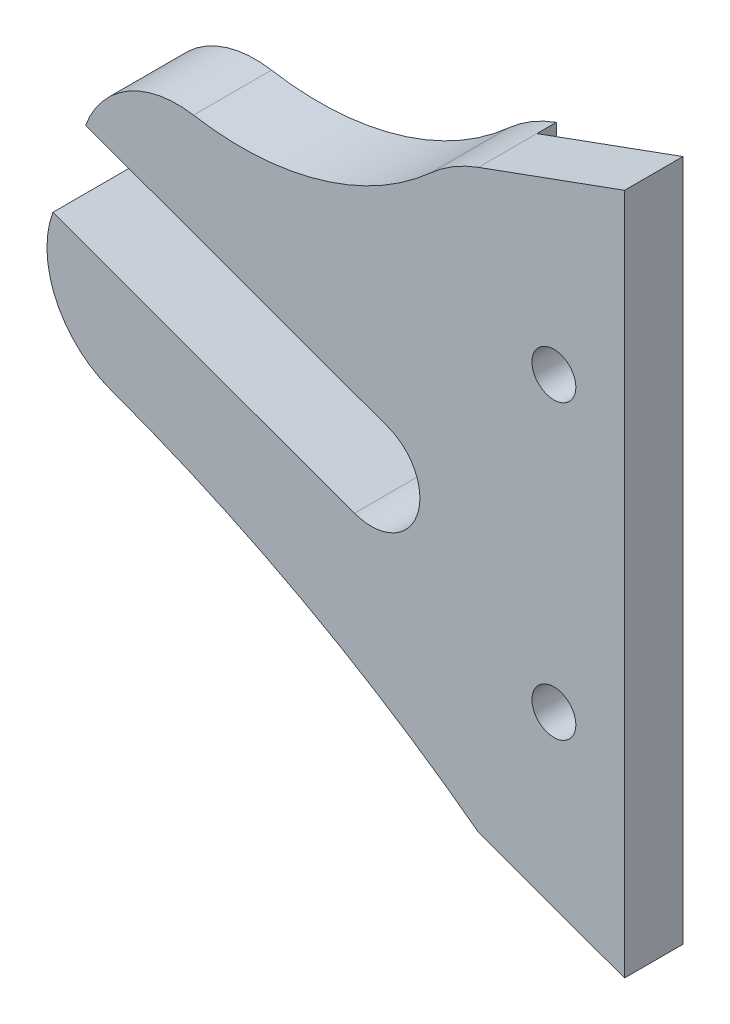
ISO-10303-21;
HEADER;
FILE_DESCRIPTION(('STEP AP214'),'2;1');
FILE_NAME('part.step','',(''),(''),'','','');
FILE_SCHEMA(('AUTOMOTIVE_DESIGN { 1 0 10303 214 1 1 1 1 }'));
ENDSEC;
DATA;
#1=APPLICATION_CONTEXT('core data for automotive mechanical design processes');
#2=APPLICATION_PROTOCOL_DEFINITION('international standard','automotive_design',2000,#1);
#3=PRODUCT_CONTEXT('',#1,'mechanical');
#4=PRODUCT('Part','Part','',(#3));
#5=PRODUCT_RELATED_PRODUCT_CATEGORY('part','',(#4));
#6=PRODUCT_DEFINITION_FORMATION('','',#4);
#7=PRODUCT_DEFINITION_CONTEXT('part definition',#1,'design');
#8=PRODUCT_DEFINITION('design','',#6,#7);
#9=PRODUCT_DEFINITION_SHAPE('','',#8);
#10=(LENGTH_UNIT() NAMED_UNIT(*) SI_UNIT(.MILLI.,.METRE.));
#11=(NAMED_UNIT(*) PLANE_ANGLE_UNIT() SI_UNIT($,.RADIAN.));
#12=(NAMED_UNIT(*) SI_UNIT($,.STERADIAN.) SOLID_ANGLE_UNIT());
#13=UNCERTAINTY_MEASURE_WITH_UNIT(LENGTH_MEASURE(1.E-05),#10,'distance_accuracy_value','');
#14=(GEOMETRIC_REPRESENTATION_CONTEXT(3) GLOBAL_UNCERTAINTY_ASSIGNED_CONTEXT((#13)) GLOBAL_UNIT_ASSIGNED_CONTEXT((#10,
#11,#12)) REPRESENTATION_CONTEXT('',''));
#15=CARTESIAN_POINT('',(0.,0.,0.));
#16=DIRECTION('',(0.,0.,1.));
#17=DIRECTION('',(1.,0.,0.));
#18=AXIS2_PLACEMENT_3D('',#15,#16,#17);
#19=CARTESIAN_POINT('',(34.3467999030987,-30.2565275166304,8.));
#20=DIRECTION('',(0.342020143325666,0.93969262078591,0.));
#21=DIRECTION('',(-0.93969262078591,0.342020143325666,0.));
#22=AXIS2_PLACEMENT_3D('',#19,#20,#21);
#23=PLANE('',#22);
#24=DIRECTION('',(-0.93969262078591,0.342020143325666,0.));
#25=VECTOR('',#24,1.);
#26=CARTESIAN_POINT('',(34.3467999030987,-30.2565275166304,2.));
#27=LINE('',#26,#25);
#28=CARTESIAN_POINT('',(34.3467999030987,-30.2565275166304,2.));
#29=VERTEX_POINT('',#28);
#30=CARTESIAN_POINT('',(19.3467999030987,-24.7969740026373,2.));
#31=VERTEX_POINT('',#30);
#32=EDGE_CURVE('E144',#29,#31,#27,.T.);
#33=ORIENTED_EDGE('',*,*,#32,.F.);
#34=DIRECTION('',(0.,0.,-1.));
#35=VECTOR('',#34,1.);
#36=CARTESIAN_POINT('',(34.3467999030987,-30.2565275166304,8.));
#37=LINE('',#36,#35);
#38=CARTESIAN_POINT('',(34.3467999030987,-30.2565275166304,8.));
#39=VERTEX_POINT('',#38);
#40=EDGE_CURVE('E39',#39,#29,#37,.T.);
#41=ORIENTED_EDGE('',*,*,#40,.F.);
#42=DIRECTION('',(0.939692620785909,-0.342020143325666,0.));
#43=VECTOR('',#42,1.);
#44=CARTESIAN_POINT('',(34.3467999030987,-30.2565275166304,8.));
#45=LINE('',#44,#43);
#46=CARTESIAN_POINT('',(19.3467999030987,-24.7969740026373,8.));
#47=VERTEX_POINT('',#46);
#48=EDGE_CURVE('E157',#47,#39,#45,.T.);
#49=ORIENTED_EDGE('',*,*,#48,.F.);
#50=DIRECTION('',(0.,0.,-1.));
#51=VECTOR('',#50,1.);
#52=CARTESIAN_POINT('',(19.3467999030987,-24.7969740026373,8.));
#53=LINE('',#52,#51);
#54=EDGE_CURVE('E137',#47,#31,#53,.T.);
#55=ORIENTED_EDGE('',*,*,#54,.T.);
#56=EDGE_LOOP('',(#33,#41,#49,#55));
#57=FACE_BOUND('',#56,.T.);
#58=ADVANCED_FACE('F31',(#57),#23,.F.);
#59=CARTESIAN_POINT('',(34.3467999030987,-30.2565275166304,8.));
#60=DIRECTION('',(-1.,0.,0.));
#61=DIRECTION('',(0.,0.,1.));
#62=AXIS2_PLACEMENT_3D('',#59,#60,#61);
#63=PLANE('',#62);
#64=DIRECTION('',(0.,-1.,0.));
#65=VECTOR('',#64,1.);
#66=CARTESIAN_POINT('',(34.3467999030987,-30.2565275166304,2.));
#67=LINE('',#66,#65);
#68=CARTESIAN_POINT('',(34.3467999030987,39.7434724833696,2.));
#69=VERTEX_POINT('',#68);
#70=EDGE_CURVE('E184',#69,#29,#67,.T.);
#71=ORIENTED_EDGE('',*,*,#70,.F.);
#72=DIRECTION('',(0.,0.,-1.));
#73=VECTOR('',#72,1.);
#74=CARTESIAN_POINT('',(34.3467999030987,39.7434724833696,8.));
#75=LINE('',#74,#73);
#76=CARTESIAN_POINT('',(34.3467999030987,39.7434724833696,8.));
#77=VERTEX_POINT('',#76);
#78=EDGE_CURVE('E177',#77,#69,#75,.T.);
#79=ORIENTED_EDGE('',*,*,#78,.F.);
#80=DIRECTION('',(0.,1.,0.));
#81=VECTOR('',#80,1.);
#82=CARTESIAN_POINT('',(34.3467999030987,-30.2565275166304,8.));
#83=LINE('',#82,#81);
#84=EDGE_CURVE('E93',#39,#77,#83,.T.);
#85=ORIENTED_EDGE('',*,*,#84,.F.);
#86=ORIENTED_EDGE('',*,*,#40,.T.);
#87=EDGE_LOOP('',(#71,#79,#85,#86));
#88=FACE_BOUND('',#87,.T.);
#89=ADVANCED_FACE('F181',(#88),#63,.F.);
#90=CARTESIAN_POINT('',(19.3467999030987,34.2839189693766,8.));
#91=DIRECTION('',(0.342020143325666,-0.93969262078591,0.));
#92=DIRECTION('',(0.93969262078591,0.342020143325666,0.));
#93=AXIS2_PLACEMENT_3D('',#90,#91,#92);
#94=PLANE('',#93);
#95=DIRECTION('',(0.93969262078591,0.342020143325666,0.));
#96=VECTOR('',#95,1.);
#97=CARTESIAN_POINT('',(19.3467999030987,34.2839189693766,2.));
#98=LINE('',#97,#96);
#99=CARTESIAN_POINT('',(19.3467999030987,34.2839189693766,2.));
#100=VERTEX_POINT('',#99);
#101=EDGE_CURVE('E193',#100,#69,#98,.T.);
#102=ORIENTED_EDGE('',*,*,#101,.F.);
#103=DIRECTION('',(0.,0.,-1.));
#104=VECTOR('',#103,1.);
#105=CARTESIAN_POINT('',(19.3467999030987,34.2839189693766,8.));
#106=LINE('',#105,#104);
#107=CARTESIAN_POINT('',(19.3467999030987,34.2839189693766,8.));
#108=VERTEX_POINT('',#107);
#109=EDGE_CURVE('E174',#108,#100,#106,.T.);
#110=ORIENTED_EDGE('',*,*,#109,.F.);
#111=DIRECTION('',(-0.939692620785909,-0.342020143325666,0.));
#112=VECTOR('',#111,1.);
#113=CARTESIAN_POINT('',(19.3467999030987,34.2839189693766,8.));
#114=LINE('',#113,#112);
#115=EDGE_CURVE('E199',#77,#108,#114,.T.);
#116=ORIENTED_EDGE('',*,*,#115,.F.);
#117=ORIENTED_EDGE('',*,*,#78,.T.);
#118=EDGE_LOOP('',(#102,#110,#116,#117));
#119=FACE_BOUND('',#118,.T.);
#120=ADVANCED_FACE('F240',(#119),#94,.F.);
#121=CARTESIAN_POINT('',(24.4771020529837,20.188529657588,8.));
#122=DIRECTION('',(0.,0.,-1.));
#123=DIRECTION('',(-1.,0.,0.));
#124=AXIS2_PLACEMENT_3D('',#121,#122,#123);
#125=CYLINDRICAL_SURFACE('',#124,15.);
#126=CARTESIAN_POINT('',(24.4771020529837,20.188529657588,0.));
#127=DIRECTION('',(0.,0.,1.));
#128=DIRECTION('',(1.,0.,0.));
#129=AXIS2_PLACEMENT_3D('',#126,#127,#128);
#130=CIRCLE('',#129,15.);
#131=CARTESIAN_POINT('',(19.3467999030987,34.2839189693766,0.));
#132=VERTEX_POINT('',#131);
#133=CARTESIAN_POINT('',(14.4581114102584,31.3518547223248,0.));
#134=VERTEX_POINT('',#133);
#135=EDGE_CURVE('E141',#132,#134,#130,.T.);
#136=ORIENTED_EDGE('',*,*,#135,.T.);
#137=DIRECTION('',(0.,0.,-1.));
#138=VECTOR('',#137,1.);
#139=CARTESIAN_POINT('',(14.4581114102584,31.3518547223248,8.));
#140=LINE('',#139,#138);
#141=CARTESIAN_POINT('',(14.4581114102584,31.3518547223248,8.));
#142=VERTEX_POINT('',#141);
#143=EDGE_CURVE('E171',#142,#134,#140,.T.);
#144=ORIENTED_EDGE('',*,*,#143,.F.);
#145=CARTESIAN_POINT('',(24.4771020529837,20.188529657588,8.));
#146=DIRECTION('',(0.,0.,1.));
#147=DIRECTION('',(1.,0.,0.));
#148=AXIS2_PLACEMENT_3D('',#145,#146,#147);
#149=CIRCLE('',#148,15.);
#150=EDGE_CURVE('E201',#108,#142,#149,.T.);
#151=ORIENTED_EDGE('',*,*,#150,.F.);
#152=ORIENTED_EDGE('',*,*,#109,.T.);
#153=DIRECTION('',(0.,0.,-1.));
#154=VECTOR('',#153,1.);
#155=CARTESIAN_POINT('',(19.3467999030987,34.2839189693766,8.));
#156=LINE('',#155,#154);
#157=EDGE_CURVE('E227',#100,#132,#156,.T.);
#158=ORIENTED_EDGE('',*,*,#157,.T.);
#159=EDGE_LOOP('',(#136,#144,#151,#152,#158));
#160=FACE_BOUND('',#159,.T.);
#161=ADVANCED_FACE('F246',(#160),#125,.T.);
#162=CARTESIAN_POINT('',(-5.00508788698816,53.038073254995,8.));
#163=DIRECTION('',(0.,0.,-1.));
#164=DIRECTION('',(-1.,0.,0.));
#165=AXIS2_PLACEMENT_3D('',#162,#163,#164);
#166=CYLINDRICAL_SURFACE('',#165,29.1394612361153);
#167=CARTESIAN_POINT('',(-5.00508788698816,53.038073254995,0.));
#168=DIRECTION('',(0.,0.,-1.));
#169=DIRECTION('',(-1.,0.,0.));
#170=AXIS2_PLACEMENT_3D('',#167,#168,#169);
#171=CIRCLE('',#170,29.1394612361153);
#172=CARTESIAN_POINT('',(-9.88228618706266,24.3096702734018,0.));
#173=VERTEX_POINT('',#172);
#174=EDGE_CURVE('E143',#134,#173,#171,.T.);
#175=ORIENTED_EDGE('',*,*,#174,.T.);
#176=DIRECTION('',(0.,0.,-1.));
#177=VECTOR('',#176,1.);
#178=CARTESIAN_POINT('',(-9.88228618706266,24.3096702734018,8.));
#179=LINE('',#178,#177);
#180=CARTESIAN_POINT('',(-9.88228618706266,24.3096702734018,8.));
#181=VERTEX_POINT('',#180);
#182=EDGE_CURVE('E168',#181,#173,#179,.T.);
#183=ORIENTED_EDGE('',*,*,#182,.F.);
#184=CARTESIAN_POINT('',(-5.00508788698816,53.038073254995,8.));
#185=DIRECTION('',(0.,0.,-1.));
#186=DIRECTION('',(-1.,0.,0.));
#187=AXIS2_PLACEMENT_3D('',#184,#185,#186);
#188=CIRCLE('',#187,29.1394612361153);
#189=EDGE_CURVE('E203',#142,#181,#188,.T.);
#190=ORIENTED_EDGE('',*,*,#189,.F.);
#191=ORIENTED_EDGE('',*,*,#143,.T.);
#192=EDGE_LOOP('',(#175,#183,#190,#191));
#193=FACE_BOUND('',#192,.T.);
#194=ADVANCED_FACE('F251',(#193),#166,.F.);
#195=CARTESIAN_POINT('',(-11.5560296583489,14.4507361123311,8.));
#196=DIRECTION('',(0.,0.,-1.));
#197=DIRECTION('',(-1.,0.,0.));
#198=AXIS2_PLACEMENT_3D('',#195,#196,#197);
#199=CYLINDRICAL_SURFACE('',#198,10.);
#200=CARTESIAN_POINT('',(-11.5560296583489,14.4507361123311,0.));
#201=DIRECTION('',(0.,0.,1.));
#202=DIRECTION('',(-1.,0.,0.));
#203=AXIS2_PLACEMENT_3D('',#200,#201,#202);
#204=CIRCLE('',#203,10.);
#205=CARTESIAN_POINT('',(-20.952955866208,17.8709375455877,0.));
#206=VERTEX_POINT('',#205);
#207=EDGE_CURVE('E146',#173,#206,#204,.T.);
#208=ORIENTED_EDGE('',*,*,#207,.T.);
#209=DIRECTION('',(0.,0.,-1.));
#210=VECTOR('',#209,1.);
#211=CARTESIAN_POINT('',(-20.952955866208,17.8709375455877,8.));
#212=LINE('',#211,#210);
#213=CARTESIAN_POINT('',(-20.952955866208,17.8709375455877,8.));
#214=VERTEX_POINT('',#213);
#215=EDGE_CURVE('E165',#214,#206,#212,.T.);
#216=ORIENTED_EDGE('',*,*,#215,.F.);
#217=CARTESIAN_POINT('',(-11.5560296583489,14.4507361123311,8.));
#218=DIRECTION('',(0.,0.,1.));
#219=DIRECTION('',(-1.,0.,0.));
#220=AXIS2_PLACEMENT_3D('',#217,#218,#219);
#221=CIRCLE('',#220,10.);
#222=EDGE_CURVE('E205',#181,#214,#221,.T.);
#223=ORIENTED_EDGE('',*,*,#222,.F.);
#224=ORIENTED_EDGE('',*,*,#182,.T.);
#225=EDGE_LOOP('',(#208,#216,#223,#224));
#226=FACE_BOUND('',#225,.T.);
#227=ADVANCED_FACE('F255',(#226),#199,.T.);
#228=CARTESIAN_POINT('',(10.0569006197271,6.58427281584078,8.));
#229=DIRECTION('',(0.342020143325666,0.93969262078591,0.));
#230=DIRECTION('',(-0.93969262078591,0.342020143325666,0.));
#231=AXIS2_PLACEMENT_3D('',#228,#229,#230);
#232=PLANE('',#231);
#233=DIRECTION('',(0.939692620785909,-0.342020143325666,0.));
#234=VECTOR('',#233,1.);
#235=CARTESIAN_POINT('',(10.0569006197271,6.58427281584078,0.));
#236=LINE('',#235,#234);
#237=CARTESIAN_POINT('',(10.0569006197271,6.58427281584078,0.));
#238=VERTEX_POINT('',#237);
#239=EDGE_CURVE('E148',#206,#238,#236,.T.);
#240=ORIENTED_EDGE('',*,*,#239,.T.);
#241=DIRECTION('',(0.,0.,-1.));
#242=VECTOR('',#241,1.);
#243=CARTESIAN_POINT('',(10.0569006197271,6.58427281584078,8.));
#244=LINE('',#243,#242);
#245=CARTESIAN_POINT('',(10.0569006197271,6.58427281584078,8.));
#246=VERTEX_POINT('',#245);
#247=EDGE_CURVE('E162',#246,#238,#244,.T.);
#248=ORIENTED_EDGE('',*,*,#247,.F.);
#249=DIRECTION('',(0.939692620785909,-0.342020143325666,0.));
#250=VECTOR('',#249,1.);
#251=CARTESIAN_POINT('',(10.0569006197271,6.58427281584078,8.));
#252=LINE('',#251,#250);
#253=EDGE_CURVE('E207',#214,#246,#252,.T.);
#254=ORIENTED_EDGE('',*,*,#253,.F.);
#255=ORIENTED_EDGE('',*,*,#215,.T.);
#256=EDGE_LOOP('',(#240,#248,#254,#255));
#257=FACE_BOUND('',#256,.T.);
#258=ADVANCED_FACE('F213',(#257),#232,.F.);
#259=CARTESIAN_POINT('',(8.34679990309873,1.88580971191123,8.));
#260=DIRECTION('',(0.,0.,-1.));
#261=DIRECTION('',(-1.,0.,0.));
#262=AXIS2_PLACEMENT_3D('',#259,#260,#261);
#263=CYLINDRICAL_SURFACE('',#262,5.);
#264=CARTESIAN_POINT('',(8.34679990309873,1.88580971191123,0.));
#265=DIRECTION('',(0.,0.,-1.));
#266=DIRECTION('',(-1.,0.,0.));
#267=AXIS2_PLACEMENT_3D('',#264,#265,#266);
#268=CIRCLE('',#267,5.);
#269=CARTESIAN_POINT('',(6.6366991864704,-2.81265339201832,0.));
#270=VERTEX_POINT('',#269);
#271=EDGE_CURVE('E150',#238,#270,#268,.T.);
#272=ORIENTED_EDGE('',*,*,#271,.T.);
#273=DIRECTION('',(0.,0.,-1.));
#274=VECTOR('',#273,1.);
#275=CARTESIAN_POINT('',(6.6366991864704,-2.81265339201832,8.));
#276=LINE('',#275,#274);
#277=CARTESIAN_POINT('',(6.6366991864704,-2.81265339201832,8.));
#278=VERTEX_POINT('',#277);
#279=EDGE_CURVE('E132',#278,#270,#276,.T.);
#280=ORIENTED_EDGE('',*,*,#279,.F.);
#281=CARTESIAN_POINT('',(8.34679990309873,1.88580971191123,8.));
#282=DIRECTION('',(0.,0.,-1.));
#283=DIRECTION('',(-1.,0.,0.));
#284=AXIS2_PLACEMENT_3D('',#281,#282,#283);
#285=CIRCLE('',#284,5.);
#286=EDGE_CURVE('E123',#246,#278,#285,.T.);
#287=ORIENTED_EDGE('',*,*,#286,.F.);
#288=ORIENTED_EDGE('',*,*,#247,.T.);
#289=EDGE_LOOP('',(#272,#280,#287,#288));
#290=FACE_BOUND('',#289,.T.);
#291=ADVANCED_FACE('F217',(#290),#263,.F.);
#292=CARTESIAN_POINT('',(-24.3170742999206,8.45359879524626,8.));
#293=DIRECTION('',(-0.342020143325666,-0.93969262078591,0.));
#294=DIRECTION('',(0.93969262078591,-0.342020143325666,0.));
#295=AXIS2_PLACEMENT_3D('',#292,#293,#294);
#296=PLANE('',#295);
#297=DIRECTION('',(-0.93969262078591,0.342020143325666,0.));
#298=VECTOR('',#297,1.);
#299=CARTESIAN_POINT('',(-24.3170742999206,8.45359879524626,0.));
#300=LINE('',#299,#298);
#301=CARTESIAN_POINT('',(-24.3170742999206,8.45359879524626,0.));
#302=VERTEX_POINT('',#301);
#303=EDGE_CURVE('E131',#270,#302,#300,.T.);
#304=ORIENTED_EDGE('',*,*,#303,.T.);
#305=DIRECTION('',(0.,0.,-1.));
#306=VECTOR('',#305,1.);
#307=CARTESIAN_POINT('',(-24.3170742999206,8.45359879524626,8.));
#308=LINE('',#307,#306);
#309=CARTESIAN_POINT('',(-24.3170742999206,8.45359879524626,8.));
#310=VERTEX_POINT('',#309);
#311=EDGE_CURVE('E128',#310,#302,#308,.T.);
#312=ORIENTED_EDGE('',*,*,#311,.F.);
#313=DIRECTION('',(-0.93969262078591,0.342020143325666,0.));
#314=VECTOR('',#313,1.);
#315=CARTESIAN_POINT('',(-24.3170742999206,8.45359879524626,8.));
#316=LINE('',#315,#314);
#317=EDGE_CURVE('E117',#278,#310,#316,.T.);
#318=ORIENTED_EDGE('',*,*,#317,.F.);
#319=ORIENTED_EDGE('',*,*,#279,.T.);
#320=EDGE_LOOP('',(#304,#312,#318,#319));
#321=FACE_BOUND('',#320,.T.);
#322=ADVANCED_FACE('F129',(#321),#296,.F.);
#323=CARTESIAN_POINT('',(-14.9201480920615,5.0333973619896,8.));
#324=DIRECTION('',(0.,0.,-1.));
#325=DIRECTION('',(-1.,0.,0.));
#326=AXIS2_PLACEMENT_3D('',#323,#324,#325);
#327=CYLINDRICAL_SURFACE('',#326,10.);
#328=CARTESIAN_POINT('',(-14.9201480920615,5.0333973619896,0.));
#329=DIRECTION('',(0.,0.,1.));
#330=DIRECTION('',(1.,0.,0.));
#331=AXIS2_PLACEMENT_3D('',#328,#329,#330);
#332=CIRCLE('',#331,10.);
#333=CARTESIAN_POINT('',(-18.3403495253182,-4.36352884586949,0.));
#334=VERTEX_POINT('',#333);
#335=EDGE_CURVE('E77',#302,#334,#332,.T.);
#336=ORIENTED_EDGE('',*,*,#335,.T.);
#337=DIRECTION('',(0.,0.,-1.));
#338=VECTOR('',#337,1.);
#339=CARTESIAN_POINT('',(-18.3403495253182,-4.36352884586949,8.));
#340=LINE('',#339,#338);
#341=CARTESIAN_POINT('',(-18.3403495253182,-4.36352884586949,8.));
#342=VERTEX_POINT('',#341);
#343=EDGE_CURVE('E133',#342,#334,#340,.T.);
#344=ORIENTED_EDGE('',*,*,#343,.F.);
#345=CARTESIAN_POINT('',(-14.9201480920615,5.0333973619896,8.));
#346=DIRECTION('',(0.,0.,1.));
#347=DIRECTION('',(1.,0.,0.));
#348=AXIS2_PLACEMENT_3D('',#345,#346,#347);
#349=CIRCLE('',#348,10.);
#350=EDGE_CURVE('E121',#310,#342,#349,.T.);
#351=ORIENTED_EDGE('',*,*,#350,.F.);
#352=ORIENTED_EDGE('',*,*,#311,.T.);
#353=EDGE_LOOP('',(#336,#344,#351,#352));
#354=FACE_BOUND('',#353,.T.);
#355=ADVANCED_FACE('F135',(#354),#327,.T.);
#356=CARTESIAN_POINT('',(-68.1376467744492,-141.180478587728,8.));
#357=DIRECTION('',(0.,0.,-1.));
#358=DIRECTION('',(-1.,0.,0.));
#359=AXIS2_PLACEMENT_3D('',#356,#357,#358);
#360=CYLINDRICAL_SURFACE('',#359,145.59755681324);
#361=CARTESIAN_POINT('',(-68.1376467744492,-141.180478587728,0.));
#362=DIRECTION('',(0.,0.,-1.));
#363=DIRECTION('',(-1.,0.,0.));
#364=AXIS2_PLACEMENT_3D('',#361,#362,#363);
#365=CIRCLE('',#364,145.59755681324);
#366=CARTESIAN_POINT('',(19.3467999030987,-24.7969740026373,0.));
#367=VERTEX_POINT('',#366);
#368=EDGE_CURVE('E154',#334,#367,#365,.T.);
#369=ORIENTED_EDGE('',*,*,#368,.T.);
#370=DIRECTION('',(0.,0.,-1.));
#371=VECTOR('',#370,1.);
#372=CARTESIAN_POINT('',(19.3467999030987,-24.7969740026373,8.));
#373=LINE('',#372,#371);
#374=EDGE_CURVE('E84',#367,#31,#373,.F.);
#375=ORIENTED_EDGE('',*,*,#374,.T.);
#376=ORIENTED_EDGE('',*,*,#54,.F.);
#377=CARTESIAN_POINT('',(-68.1376467744492,-141.180478587728,8.));
#378=DIRECTION('',(0.,0.,-1.));
#379=DIRECTION('',(-1.,0.,0.));
#380=AXIS2_PLACEMENT_3D('',#377,#378,#379);
#381=CIRCLE('',#380,145.59755681324);
#382=EDGE_CURVE('E47',#342,#47,#381,.T.);
#383=ORIENTED_EDGE('',*,*,#382,.F.);
#384=ORIENTED_EDGE('',*,*,#343,.T.);
#385=EDGE_LOOP('',(#369,#375,#376,#383,#384));
#386=FACE_BOUND('',#385,.T.);
#387=ADVANCED_FACE('F223',(#386),#360,.F.);
#388=CARTESIAN_POINT('',(-68.1376467744492,-141.180478587728,8.));
#389=DIRECTION('',(0.,0.,-1.));
#390=DIRECTION('',(-1.,0.,0.));
#391=AXIS2_PLACEMENT_3D('',#388,#389,#390);
#392=PLANE('',#391);
#393=CARTESIAN_POINT('',(27.0967999030987,-10.2565275166304,8.));
#394=DIRECTION('',(0.,0.,-1.));
#395=DIRECTION('',(-1.,0.,0.));
#396=AXIS2_PLACEMENT_3D('',#393,#394,#395);
#397=CIRCLE('',#396,2.25);
#398=CARTESIAN_POINT('',(24.8467999030987,-10.2565275166304,8.));
#399=VERTEX_POINT('',#398);
#400=EDGE_CURVE('E304',#399,#399,#397,.T.);
#401=ORIENTED_EDGE('',*,*,#400,.T.);
#402=EDGE_LOOP('',(#401));
#403=FACE_BOUND('',#402,.T.);
#404=CARTESIAN_POINT('',(27.0967999030987,19.7434724833696,8.));
#405=DIRECTION('',(0.,0.,-1.));
#406=DIRECTION('',(-1.,0.,0.));
#407=AXIS2_PLACEMENT_3D('',#404,#405,#406);
#408=CIRCLE('',#407,2.25);
#409=CARTESIAN_POINT('',(24.8467999030987,19.7434724833696,8.));
#410=VERTEX_POINT('',#409);
#411=EDGE_CURVE('E232',#410,#410,#408,.T.);
#412=ORIENTED_EDGE('',*,*,#411,.T.);
#413=EDGE_LOOP('',(#412));
#414=FACE_BOUND('',#413,.T.);
#415=ORIENTED_EDGE('',*,*,#48,.T.);
#416=ORIENTED_EDGE('',*,*,#84,.T.);
#417=ORIENTED_EDGE('',*,*,#115,.T.);
#418=ORIENTED_EDGE('',*,*,#150,.T.);
#419=ORIENTED_EDGE('',*,*,#189,.T.);
#420=ORIENTED_EDGE('',*,*,#222,.T.);
#421=ORIENTED_EDGE('',*,*,#253,.T.);
#422=ORIENTED_EDGE('',*,*,#286,.T.);
#423=ORIENTED_EDGE('',*,*,#317,.T.);
#424=ORIENTED_EDGE('',*,*,#350,.T.);
#425=ORIENTED_EDGE('',*,*,#382,.T.);
#426=EDGE_LOOP('',(#415,#416,#417,#418,#419,#420,#421,#422,#423,#424,#425));
#427=FACE_BOUND('',#426,.T.);
#428=ADVANCED_FACE('F119',(#403,#414,#427),#392,.F.);
#429=CARTESIAN_POINT('',(-68.1376467744492,-141.180478587728,0.));
#430=DIRECTION('',(0.,0.,-1.));
#431=DIRECTION('',(-1.,0.,0.));
#432=AXIS2_PLACEMENT_3D('',#429,#430,#431);
#433=PLANE('',#432);
#434=DIRECTION('',(0.,1.,0.));
#435=VECTOR('',#434,1.);
#436=CARTESIAN_POINT('',(19.3467999030987,-141.180478587728,0.));
#437=LINE('',#436,#435);
#438=EDGE_CURVE('E11',#367,#132,#437,.T.);
#439=ORIENTED_EDGE('',*,*,#438,.F.);
#440=ORIENTED_EDGE('',*,*,#368,.F.);
#441=ORIENTED_EDGE('',*,*,#335,.F.);
#442=ORIENTED_EDGE('',*,*,#303,.F.);
#443=ORIENTED_EDGE('',*,*,#271,.F.);
#444=ORIENTED_EDGE('',*,*,#239,.F.);
#445=ORIENTED_EDGE('',*,*,#207,.F.);
#446=ORIENTED_EDGE('',*,*,#174,.F.);
#447=ORIENTED_EDGE('',*,*,#135,.F.);
#448=EDGE_LOOP('',(#439,#440,#441,#442,#443,#444,#445,#446,#447));
#449=FACE_BOUND('',#448,.T.);
#450=ADVANCED_FACE('F219',(#449),#433,.T.);
#451=CARTESIAN_POINT('',(36.4385784797573,-34.8233220169266,2.));
#452=DIRECTION('',(0.,0.,-1.));
#453=DIRECTION('',(-1.,0.,0.));
#454=AXIS2_PLACEMENT_3D('',#451,#452,#453);
#455=PLANE('',#454);
#456=CARTESIAN_POINT('',(27.0967999030987,-10.2565275166304,2.));
#457=DIRECTION('',(0.,0.,-1.));
#458=DIRECTION('',(-1.,0.,0.));
#459=AXIS2_PLACEMENT_3D('',#456,#457,#458);
#460=CIRCLE('',#459,2.25);
#461=CARTESIAN_POINT('',(24.8467999030987,-10.2565275166304,2.));
#462=VERTEX_POINT('',#461);
#463=EDGE_CURVE('E311',#462,#462,#460,.T.);
#464=ORIENTED_EDGE('',*,*,#463,.F.);
#465=EDGE_LOOP('',(#464));
#466=FACE_BOUND('',#465,.T.);
#467=CARTESIAN_POINT('',(27.0967999030987,19.7434724833696,2.));
#468=DIRECTION('',(0.,0.,-1.));
#469=DIRECTION('',(-1.,0.,0.));
#470=AXIS2_PLACEMENT_3D('',#467,#468,#469);
#471=CIRCLE('',#470,2.25);
#472=CARTESIAN_POINT('',(24.8467999030987,19.7434724833696,2.));
#473=VERTEX_POINT('',#472);
#474=EDGE_CURVE('E307',#473,#473,#471,.T.);
#475=ORIENTED_EDGE('',*,*,#474,.F.);
#476=EDGE_LOOP('',(#475));
#477=FACE_BOUND('',#476,.T.);
#478=ORIENTED_EDGE('',*,*,#32,.T.);
#479=DIRECTION('',(0.,1.,0.));
#480=VECTOR('',#479,1.);
#481=CARTESIAN_POINT('',(19.3467999030987,42.1569720448743,2.));
#482=LINE('',#481,#480);
#483=EDGE_CURVE('E228',#31,#100,#482,.T.);
#484=ORIENTED_EDGE('',*,*,#483,.T.);
#485=ORIENTED_EDGE('',*,*,#101,.T.);
#486=ORIENTED_EDGE('',*,*,#70,.T.);
#487=EDGE_LOOP('',(#478,#484,#485,#486));
#488=FACE_BOUND('',#487,.T.);
#489=ADVANCED_FACE('F237',(#466,#477,#488),#455,.T.);
#490=CARTESIAN_POINT('',(19.3467999030987,42.1569720448743,2.));
#491=DIRECTION('',(-1.,0.,0.));
#492=DIRECTION('',(0.,-1.,0.));
#493=AXIS2_PLACEMENT_3D('',#490,#491,#492);
#494=PLANE('',#493);
#495=ORIENTED_EDGE('',*,*,#483,.F.);
#496=ORIENTED_EDGE('',*,*,#374,.F.);
#497=ORIENTED_EDGE('',*,*,#438,.T.);
#498=ORIENTED_EDGE('',*,*,#157,.F.);
#499=EDGE_LOOP('',(#495,#496,#497,#498));
#500=FACE_BOUND('',#499,.T.);
#501=ADVANCED_FACE('F257',(#500),#494,.F.);
#502=CARTESIAN_POINT('',(27.0967999030987,19.7434724833696,8.));
#503=DIRECTION('',(0.,0.,-1.));
#504=DIRECTION('',(-1.,0.,0.));
#505=AXIS2_PLACEMENT_3D('',#502,#503,#504);
#506=CYLINDRICAL_SURFACE('',#505,2.25);
#507=ORIENTED_EDGE('',*,*,#411,.F.);
#508=EDGE_LOOP('',(#507));
#509=FACE_BOUND('',#508,.T.);
#510=ORIENTED_EDGE('',*,*,#474,.T.);
#511=EDGE_LOOP('',(#510));
#512=FACE_BOUND('',#511,.T.);
#513=ADVANCED_FACE('F259',(#509,#512),#506,.F.);
#514=CARTESIAN_POINT('',(27.0967999030987,-10.2565275166304,8.));
#515=DIRECTION('',(0.,0.,-1.));
#516=DIRECTION('',(-1.,0.,0.));
#517=AXIS2_PLACEMENT_3D('',#514,#515,#516);
#518=CYLINDRICAL_SURFACE('',#517,2.25);
#519=ORIENTED_EDGE('',*,*,#400,.F.);
#520=EDGE_LOOP('',(#519));
#521=FACE_BOUND('',#520,.T.);
#522=ORIENTED_EDGE('',*,*,#463,.T.);
#523=EDGE_LOOP('',(#522));
#524=FACE_BOUND('',#523,.T.);
#525=ADVANCED_FACE('F265',(#521,#524),#518,.F.);
#526=CLOSED_SHELL('',(#58,#89,#120,#161,#194,#227,#258,#291,#322,#355,#387,#428,#450,#489,#501,
#513,#525));
#527=MANIFOLD_SOLID_BREP('B2',#526);
#528=ADVANCED_BREP_SHAPE_REPRESENTATION('',(#18,#527),#14);
#529=SHAPE_DEFINITION_REPRESENTATION(#9,#528);
ENDSEC;
END-ISO-10303-21;
